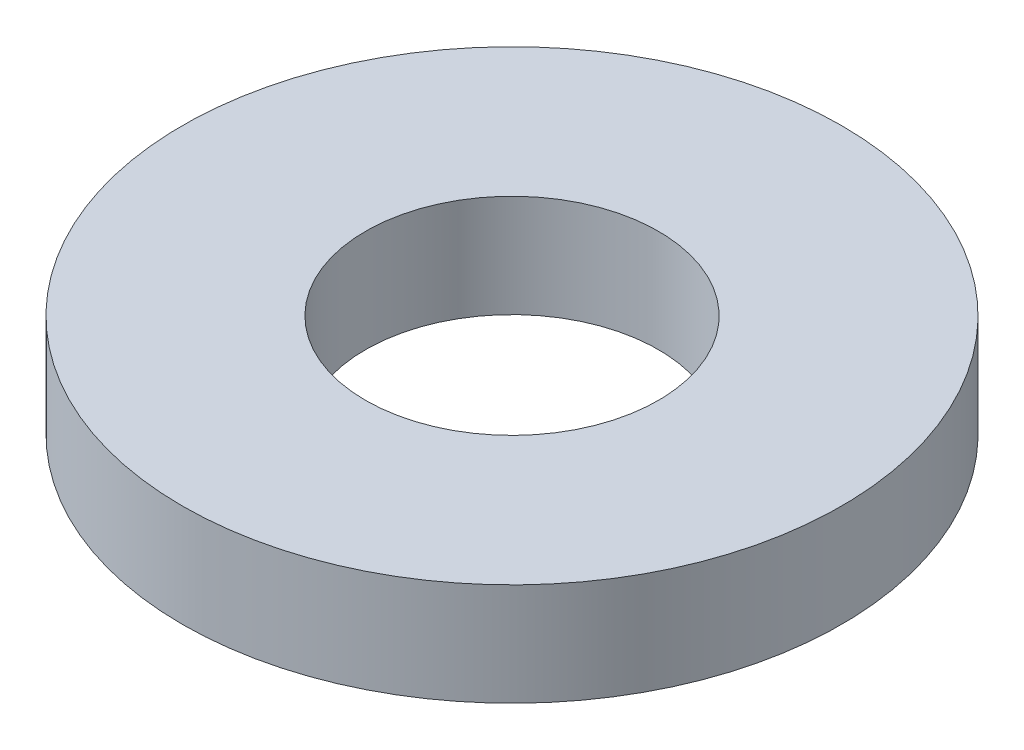
ISO-10303-21;
HEADER;
FILE_DESCRIPTION(('STEP AP214'),'2;1');
FILE_NAME('part.step','',(''),(''),'','','');
FILE_SCHEMA(('AUTOMOTIVE_DESIGN { 1 0 10303 214 1 1 1 1 }'));
ENDSEC;
DATA;
#1=APPLICATION_CONTEXT('core data for automotive mechanical design processes');
#2=APPLICATION_PROTOCOL_DEFINITION('international standard','automotive_design',2000,#1);
#3=PRODUCT_CONTEXT('',#1,'mechanical');
#4=PRODUCT('Part','Part','',(#3));
#5=PRODUCT_RELATED_PRODUCT_CATEGORY('part','',(#4));
#6=PRODUCT_DEFINITION_FORMATION('','',#4);
#7=PRODUCT_DEFINITION_CONTEXT('part definition',#1,'design');
#8=PRODUCT_DEFINITION('design','',#6,#7);
#9=PRODUCT_DEFINITION_SHAPE('','',#8);
#10=(LENGTH_UNIT() NAMED_UNIT(*) SI_UNIT(.MILLI.,.METRE.));
#11=(NAMED_UNIT(*) PLANE_ANGLE_UNIT() SI_UNIT($,.RADIAN.));
#12=(NAMED_UNIT(*) SI_UNIT($,.STERADIAN.) SOLID_ANGLE_UNIT());
#13=UNCERTAINTY_MEASURE_WITH_UNIT(LENGTH_MEASURE(1.E-05),#10,'distance_accuracy_value','');
#14=(GEOMETRIC_REPRESENTATION_CONTEXT(3) GLOBAL_UNCERTAINTY_ASSIGNED_CONTEXT((#13)) GLOBAL_UNIT_ASSIGNED_CONTEXT((#10,
#11,#12)) REPRESENTATION_CONTEXT('',''));
#15=CARTESIAN_POINT('',(0.,0.,0.));
#16=DIRECTION('',(0.,0.,1.));
#17=DIRECTION('',(1.,0.,0.));
#18=AXIS2_PLACEMENT_3D('',#15,#16,#17);
#19=CARTESIAN_POINT('',(0.,28.,0.));
#20=DIRECTION('',(0.,-1.,0.));
#21=DIRECTION('',(0.,0.,-1.));
#22=AXIS2_PLACEMENT_3D('',#19,#20,#21);
#23=CYLINDRICAL_SURFACE('',#22,90.);
#24=CARTESIAN_POINT('',(0.,28.,0.));
#25=DIRECTION('',(0.,1.,0.));
#26=DIRECTION('',(0.,0.,1.));
#27=AXIS2_PLACEMENT_3D('',#24,#25,#26);
#28=CIRCLE('',#27,90.);
#29=CARTESIAN_POINT('',(0.,28.,90.));
#30=VERTEX_POINT('',#29);
#31=EDGE_CURVE('E10',#30,#30,#28,.T.);
#32=ORIENTED_EDGE('',*,*,#31,.F.);
#33=EDGE_LOOP('',(#32));
#34=FACE_BOUND('',#33,.T.);
#35=CARTESIAN_POINT('',(0.,0.,0.));
#36=DIRECTION('',(0.,1.,0.));
#37=DIRECTION('',(0.,0.,1.));
#38=AXIS2_PLACEMENT_3D('',#35,#36,#37);
#39=CIRCLE('',#38,90.);
#40=CARTESIAN_POINT('',(0.,0.,90.));
#41=VERTEX_POINT('',#40);
#42=EDGE_CURVE('E37',#41,#41,#39,.T.);
#43=ORIENTED_EDGE('',*,*,#42,.T.);
#44=EDGE_LOOP('',(#43));
#45=FACE_BOUND('',#44,.T.);
#46=ADVANCED_FACE('F40',(#34,#45),#23,.T.);
#47=CARTESIAN_POINT('',(0.,28.,0.));
#48=DIRECTION('',(0.,1.,0.));
#49=DIRECTION('',(0.,0.,1.));
#50=AXIS2_PLACEMENT_3D('',#47,#48,#49);
#51=PLANE('',#50);
#52=CARTESIAN_POINT('',(0.,28.,0.));
#53=DIRECTION('',(0.,1.,0.));
#54=DIRECTION('',(0.,0.,1.));
#55=AXIS2_PLACEMENT_3D('',#52,#53,#54);
#56=CIRCLE('',#55,40.);
#57=CARTESIAN_POINT('',(0.,28.,40.));
#58=VERTEX_POINT('',#57);
#59=EDGE_CURVE('E50',#58,#58,#56,.T.);
#60=ORIENTED_EDGE('',*,*,#59,.F.);
#61=EDGE_LOOP('',(#60));
#62=FACE_BOUND('',#61,.T.);
#63=ORIENTED_EDGE('',*,*,#31,.T.);
#64=EDGE_LOOP('',(#63));
#65=FACE_BOUND('',#64,.T.);
#66=ADVANCED_FACE('F59',(#62,#65),#51,.T.);
#67=CARTESIAN_POINT('',(0.,0.,0.));
#68=DIRECTION('',(0.,1.,0.));
#69=DIRECTION('',(0.,0.,1.));
#70=AXIS2_PLACEMENT_3D('',#67,#68,#69);
#71=PLANE('',#70);
#72=CARTESIAN_POINT('',(0.,0.,0.));
#73=DIRECTION('',(0.,1.,0.));
#74=DIRECTION('',(0.,0.,1.));
#75=AXIS2_PLACEMENT_3D('',#72,#73,#74);
#76=CIRCLE('',#75,40.);
#77=CARTESIAN_POINT('',(0.,0.,40.));
#78=VERTEX_POINT('',#77);
#79=EDGE_CURVE('E47',#78,#78,#76,.T.);
#80=ORIENTED_EDGE('',*,*,#79,.T.);
#81=EDGE_LOOP('',(#80));
#82=FACE_BOUND('',#81,.T.);
#83=ORIENTED_EDGE('',*,*,#42,.F.);
#84=EDGE_LOOP('',(#83));
#85=FACE_BOUND('',#84,.T.);
#86=ADVANCED_FACE('F58',(#82,#85),#71,.F.);
#87=CARTESIAN_POINT('',(0.,28.,0.));
#88=DIRECTION('',(0.,-1.,0.));
#89=DIRECTION('',(0.,0.,-1.));
#90=AXIS2_PLACEMENT_3D('',#87,#88,#89);
#91=CYLINDRICAL_SURFACE('',#90,40.);
#92=ORIENTED_EDGE('',*,*,#59,.T.);
#93=EDGE_LOOP('',(#92));
#94=FACE_BOUND('',#93,.T.);
#95=ORIENTED_EDGE('',*,*,#79,.F.);
#96=EDGE_LOOP('',(#95));
#97=FACE_BOUND('',#96,.T.);
#98=ADVANCED_FACE('F54',(#94,#97),#91,.F.);
#99=CLOSED_SHELL('',(#46,#66,#86,#98));
#100=MANIFOLD_SOLID_BREP('B2',#99);
#101=ADVANCED_BREP_SHAPE_REPRESENTATION('',(#18,#100),#14);
#102=SHAPE_DEFINITION_REPRESENTATION(#9,#101);
ENDSEC;
END-ISO-10303-21;
